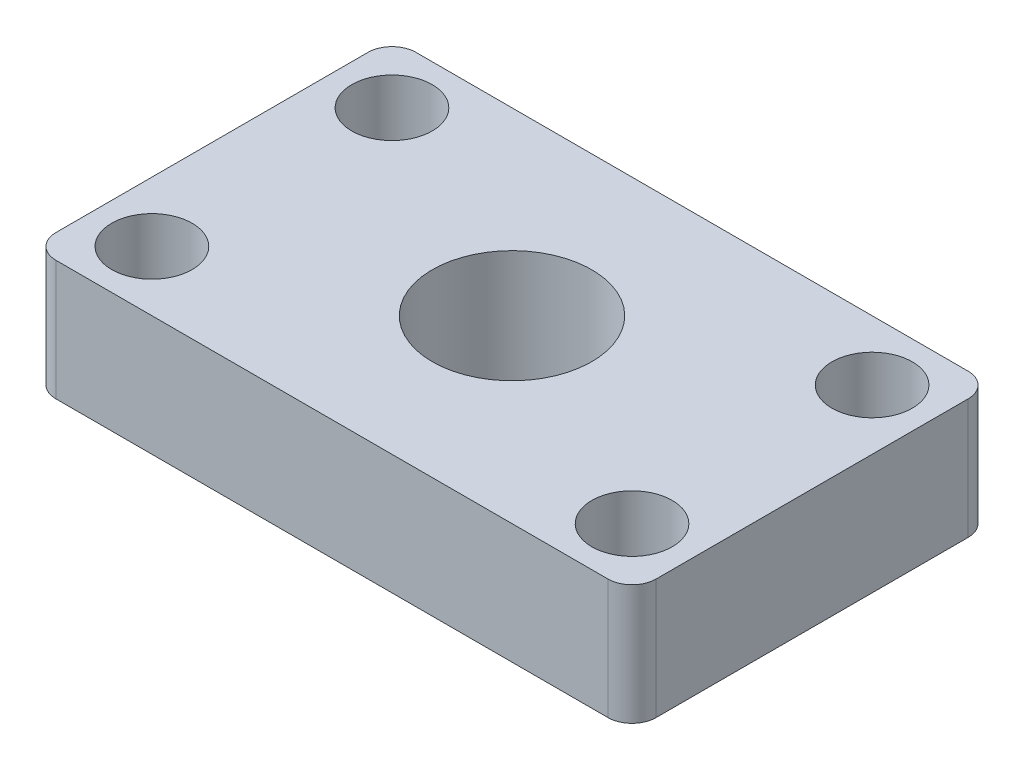
ISO-10303-21;
HEADER;
FILE_DESCRIPTION(('STEP AP214'),'2;1');
FILE_NAME('part.step','',(''),(''),'','','');
FILE_SCHEMA(('AUTOMOTIVE_DESIGN { 1 0 10303 214 1 1 1 1 }'));
ENDSEC;
DATA;
#1=APPLICATION_CONTEXT('core data for automotive mechanical design processes');
#2=APPLICATION_PROTOCOL_DEFINITION('international standard','automotive_design',2000,#1);
#3=PRODUCT_CONTEXT('',#1,'mechanical');
#4=PRODUCT('Part','Part','',(#3));
#5=PRODUCT_RELATED_PRODUCT_CATEGORY('part','',(#4));
#6=PRODUCT_DEFINITION_FORMATION('','',#4);
#7=PRODUCT_DEFINITION_CONTEXT('part definition',#1,'design');
#8=PRODUCT_DEFINITION('design','',#6,#7);
#9=PRODUCT_DEFINITION_SHAPE('','',#8);
#10=(LENGTH_UNIT() NAMED_UNIT(*) SI_UNIT(.MILLI.,.METRE.));
#11=(NAMED_UNIT(*) PLANE_ANGLE_UNIT() SI_UNIT($,.RADIAN.));
#12=(NAMED_UNIT(*) SI_UNIT($,.STERADIAN.) SOLID_ANGLE_UNIT());
#13=UNCERTAINTY_MEASURE_WITH_UNIT(LENGTH_MEASURE(1.E-05),#10,'distance_accuracy_value','');
#14=(GEOMETRIC_REPRESENTATION_CONTEXT(3) GLOBAL_UNCERTAINTY_ASSIGNED_CONTEXT((#13)) GLOBAL_UNIT_ASSIGNED_CONTEXT((#10,
#11,#12)) REPRESENTATION_CONTEXT('',''));
#15=CARTESIAN_POINT('',(0.,0.,0.));
#16=DIRECTION('',(0.,0.,1.));
#17=DIRECTION('',(1.,0.,0.));
#18=AXIS2_PLACEMENT_3D('',#15,#16,#17);
#19=CARTESIAN_POINT('',(0.,10.,0.));
#20=DIRECTION('',(0.,1.,0.));
#21=DIRECTION('',(0.,0.,1.));
#22=AXIS2_PLACEMENT_3D('',#19,#20,#21);
#23=PLANE('',#22);
#24=CARTESIAN_POINT('',(0.,10.,0.));
#25=DIRECTION('',(0.,1.,0.));
#26=DIRECTION('',(0.,0.,1.));
#27=AXIS2_PLACEMENT_3D('',#24,#25,#26);
#28=CIRCLE('',#27,6.64209999999999);
#29=CARTESIAN_POINT('',(0.,10.,6.64209999999999));
#30=VERTEX_POINT('',#29);
#31=EDGE_CURVE('E429',#30,#30,#28,.T.);
#32=ORIENTED_EDGE('',*,*,#31,.F.);
#33=EDGE_LOOP('',(#32));
#34=FACE_BOUND('',#33,.T.);
#35=CARTESIAN_POINT('',(-20.,10.,10.));
#36=DIRECTION('',(0.,1.,0.));
#37=DIRECTION('',(0.,0.,1.));
#38=AXIS2_PLACEMENT_3D('',#35,#36,#37);
#39=CIRCLE('',#38,3.35);
#40=CARTESIAN_POINT('',(-20.,10.,13.35));
#41=VERTEX_POINT('',#40);
#42=EDGE_CURVE('E144',#41,#41,#39,.T.);
#43=ORIENTED_EDGE('',*,*,#42,.F.);
#44=EDGE_LOOP('',(#43));
#45=FACE_BOUND('',#44,.T.);
#46=CARTESIAN_POINT('',(20.,10.,-10.));
#47=DIRECTION('',(0.,1.,0.));
#48=DIRECTION('',(0.,0.,1.));
#49=AXIS2_PLACEMENT_3D('',#46,#47,#48);
#50=CIRCLE('',#49,3.35);
#51=CARTESIAN_POINT('',(20.,10.,-6.65));
#52=VERTEX_POINT('',#51);
#53=EDGE_CURVE('E156',#52,#52,#50,.T.);
#54=ORIENTED_EDGE('',*,*,#53,.F.);
#55=EDGE_LOOP('',(#54));
#56=FACE_BOUND('',#55,.T.);
#57=DIRECTION('',(0.,0.,1.));
#58=VECTOR('',#57,1.);
#59=CARTESIAN_POINT('',(-25.,10.,-15.));
#60=LINE('',#59,#58);
#61=CARTESIAN_POINT('',(-25.,10.,-13.));
#62=VERTEX_POINT('',#61);
#63=CARTESIAN_POINT('',(-25.,10.,13.));
#64=VERTEX_POINT('',#63);
#65=EDGE_CURVE('E169',#62,#64,#60,.T.);
#66=ORIENTED_EDGE('',*,*,#65,.T.);
#67=CARTESIAN_POINT('',(-23.,10.,13.));
#68=DIRECTION('',(0.,1.,0.));
#69=DIRECTION('',(0.,0.,1.));
#70=AXIS2_PLACEMENT_3D('',#67,#68,#69);
#71=CIRCLE('',#70,2.);
#72=CARTESIAN_POINT('',(-23.,10.,15.));
#73=VERTEX_POINT('',#72);
#74=EDGE_CURVE('E13',#64,#73,#71,.T.);
#75=ORIENTED_EDGE('',*,*,#74,.T.);
#76=DIRECTION('',(1.,0.,0.));
#77=VECTOR('',#76,1.);
#78=CARTESIAN_POINT('',(-25.,10.,15.));
#79=LINE('',#78,#77);
#80=CARTESIAN_POINT('',(23.,10.,15.));
#81=VERTEX_POINT('',#80);
#82=EDGE_CURVE('E171',#73,#81,#79,.T.);
#83=ORIENTED_EDGE('',*,*,#82,.T.);
#84=CARTESIAN_POINT('',(23.,10.,13.));
#85=DIRECTION('',(0.,1.,0.));
#86=DIRECTION('',(0.,0.,1.));
#87=AXIS2_PLACEMENT_3D('',#84,#85,#86);
#88=CIRCLE('',#87,2.);
#89=CARTESIAN_POINT('',(25.,10.,13.));
#90=VERTEX_POINT('',#89);
#91=EDGE_CURVE('E198',#81,#90,#88,.T.);
#92=ORIENTED_EDGE('',*,*,#91,.T.);
#93=DIRECTION('',(0.,0.,-1.));
#94=VECTOR('',#93,1.);
#95=CARTESIAN_POINT('',(25.,10.,-15.));
#96=LINE('',#95,#94);
#97=CARTESIAN_POINT('',(25.,10.,-13.));
#98=VERTEX_POINT('',#97);
#99=EDGE_CURVE('E162',#90,#98,#96,.T.);
#100=ORIENTED_EDGE('',*,*,#99,.T.);
#101=CARTESIAN_POINT('',(23.,10.,-13.));
#102=DIRECTION('',(0.,1.,0.));
#103=DIRECTION('',(0.,0.,1.));
#104=AXIS2_PLACEMENT_3D('',#101,#102,#103);
#105=CIRCLE('',#104,2.);
#106=CARTESIAN_POINT('',(23.,10.,-15.));
#107=VERTEX_POINT('',#106);
#108=EDGE_CURVE('E196',#98,#107,#105,.T.);
#109=ORIENTED_EDGE('',*,*,#108,.T.);
#110=DIRECTION('',(-1.,0.,0.));
#111=VECTOR('',#110,1.);
#112=CARTESIAN_POINT('',(-25.,10.,-15.));
#113=LINE('',#112,#111);
#114=CARTESIAN_POINT('',(-23.,10.,-15.));
#115=VERTEX_POINT('',#114);
#116=EDGE_CURVE('E165',#107,#115,#113,.T.);
#117=ORIENTED_EDGE('',*,*,#116,.T.);
#118=CARTESIAN_POINT('',(-23.,10.,-13.));
#119=DIRECTION('',(0.,1.,0.));
#120=DIRECTION('',(0.,0.,1.));
#121=AXIS2_PLACEMENT_3D('',#118,#119,#120);
#122=CIRCLE('',#121,2.);
#123=EDGE_CURVE('E200',#115,#62,#122,.T.);
#124=ORIENTED_EDGE('',*,*,#123,.T.);
#125=EDGE_LOOP('',(#66,#75,#83,#92,#100,#109,#117,#124));
#126=FACE_BOUND('',#125,.T.);
#127=CARTESIAN_POINT('',(-20.,10.,-10.));
#128=DIRECTION('',(0.,1.,0.));
#129=DIRECTION('',(0.,0.,1.));
#130=AXIS2_PLACEMENT_3D('',#127,#128,#129);
#131=CIRCLE('',#130,3.35);
#132=CARTESIAN_POINT('',(-20.,10.,-6.65));
#133=VERTEX_POINT('',#132);
#134=EDGE_CURVE('E150',#133,#133,#131,.T.);
#135=ORIENTED_EDGE('',*,*,#134,.F.);
#136=EDGE_LOOP('',(#135));
#137=FACE_BOUND('',#136,.T.);
#138=CARTESIAN_POINT('',(20.,10.,10.));
#139=DIRECTION('',(0.,1.,0.));
#140=DIRECTION('',(0.,0.,1.));
#141=AXIS2_PLACEMENT_3D('',#138,#139,#140);
#142=CIRCLE('',#141,3.35);
#143=CARTESIAN_POINT('',(20.,10.,13.35));
#144=VERTEX_POINT('',#143);
#145=EDGE_CURVE('E134',#144,#144,#142,.T.);
#146=ORIENTED_EDGE('',*,*,#145,.F.);
#147=EDGE_LOOP('',(#146));
#148=FACE_BOUND('',#147,.T.);
#149=ADVANCED_FACE('F54',(#34,#45,#56,#126,#137,#148),#23,.T.);
#150=CARTESIAN_POINT('',(0.,0.,0.));
#151=DIRECTION('',(0.,1.,0.));
#152=DIRECTION('',(0.,0.,1.));
#153=AXIS2_PLACEMENT_3D('',#150,#151,#152);
#154=PLANE('',#153);
#155=CARTESIAN_POINT('',(0.,0.,0.));
#156=DIRECTION('',(0.,1.,0.));
#157=DIRECTION('',(0.,0.,1.));
#158=AXIS2_PLACEMENT_3D('',#155,#156,#157);
#159=CIRCLE('',#158,6.6421);
#160=CARTESIAN_POINT('',(0.,0.,6.6421));
#161=VERTEX_POINT('',#160);
#162=EDGE_CURVE('E137',#161,#161,#159,.T.);
#163=ORIENTED_EDGE('',*,*,#162,.T.);
#164=EDGE_LOOP('',(#163));
#165=FACE_BOUND('',#164,.T.);
#166=DIRECTION('',(1.,0.,0.));
#167=VECTOR('',#166,1.);
#168=CARTESIAN_POINT('',(-25.,0.,15.));
#169=LINE('',#168,#167);
#170=CARTESIAN_POINT('',(-23.,0.,15.));
#171=VERTEX_POINT('',#170);
#172=CARTESIAN_POINT('',(23.,0.,15.));
#173=VERTEX_POINT('',#172);
#174=EDGE_CURVE('E166',#171,#173,#169,.T.);
#175=ORIENTED_EDGE('',*,*,#174,.F.);
#176=CARTESIAN_POINT('',(-23.,0.,13.));
#177=DIRECTION('',(0.,1.,0.));
#178=DIRECTION('',(0.,0.,1.));
#179=AXIS2_PLACEMENT_3D('',#176,#177,#178);
#180=CIRCLE('',#179,2.);
#181=CARTESIAN_POINT('',(-25.,0.,13.));
#182=VERTEX_POINT('',#181);
#183=EDGE_CURVE('E76',#171,#182,#180,.F.);
#184=ORIENTED_EDGE('',*,*,#183,.T.);
#185=DIRECTION('',(0.,0.,1.));
#186=VECTOR('',#185,1.);
#187=CARTESIAN_POINT('',(-25.,0.,-15.));
#188=LINE('',#187,#186);
#189=CARTESIAN_POINT('',(-25.,0.,-13.));
#190=VERTEX_POINT('',#189);
#191=EDGE_CURVE('E179',#190,#182,#188,.T.);
#192=ORIENTED_EDGE('',*,*,#191,.F.);
#193=CARTESIAN_POINT('',(-23.,0.,-13.));
#194=DIRECTION('',(0.,1.,0.));
#195=DIRECTION('',(0.,0.,1.));
#196=AXIS2_PLACEMENT_3D('',#193,#194,#195);
#197=CIRCLE('',#196,2.);
#198=CARTESIAN_POINT('',(-23.,0.,-15.));
#199=VERTEX_POINT('',#198);
#200=EDGE_CURVE('E189',#190,#199,#197,.F.);
#201=ORIENTED_EDGE('',*,*,#200,.T.);
#202=DIRECTION('',(-1.,0.,0.));
#203=VECTOR('',#202,1.);
#204=CARTESIAN_POINT('',(-25.,0.,-15.));
#205=LINE('',#204,#203);
#206=CARTESIAN_POINT('',(23.,0.,-15.));
#207=VERTEX_POINT('',#206);
#208=EDGE_CURVE('E176',#207,#199,#205,.T.);
#209=ORIENTED_EDGE('',*,*,#208,.F.);
#210=CARTESIAN_POINT('',(23.,0.,-13.));
#211=DIRECTION('',(0.,1.,0.));
#212=DIRECTION('',(0.,0.,1.));
#213=AXIS2_PLACEMENT_3D('',#210,#211,#212);
#214=CIRCLE('',#213,2.);
#215=CARTESIAN_POINT('',(25.,0.,-13.));
#216=VERTEX_POINT('',#215);
#217=EDGE_CURVE('E184',#207,#216,#214,.F.);
#218=ORIENTED_EDGE('',*,*,#217,.T.);
#219=DIRECTION('',(0.,0.,-1.));
#220=VECTOR('',#219,1.);
#221=CARTESIAN_POINT('',(25.,0.,-15.));
#222=LINE('',#221,#220);
#223=CARTESIAN_POINT('',(25.,0.,13.));
#224=VERTEX_POINT('',#223);
#225=EDGE_CURVE('E159',#224,#216,#222,.T.);
#226=ORIENTED_EDGE('',*,*,#225,.F.);
#227=CARTESIAN_POINT('',(23.,0.,13.));
#228=DIRECTION('',(0.,1.,0.));
#229=DIRECTION('',(0.,0.,1.));
#230=AXIS2_PLACEMENT_3D('',#227,#228,#229);
#231=CIRCLE('',#230,2.);
#232=EDGE_CURVE('E186',#224,#173,#231,.F.);
#233=ORIENTED_EDGE('',*,*,#232,.T.);
#234=EDGE_LOOP('',(#175,#184,#192,#201,#209,#218,#226,#233));
#235=FACE_BOUND('',#234,.T.);
#236=CARTESIAN_POINT('',(20.,0.,-10.));
#237=DIRECTION('',(0.,1.,0.));
#238=DIRECTION('',(0.,0.,1.));
#239=AXIS2_PLACEMENT_3D('',#236,#237,#238);
#240=CIRCLE('',#239,3.35);
#241=CARTESIAN_POINT('',(20.,0.,-6.65));
#242=VERTEX_POINT('',#241);
#243=EDGE_CURVE('E153',#242,#242,#240,.T.);
#244=ORIENTED_EDGE('',*,*,#243,.T.);
#245=EDGE_LOOP('',(#244));
#246=FACE_BOUND('',#245,.T.);
#247=CARTESIAN_POINT('',(-20.,0.,-10.));
#248=DIRECTION('',(0.,1.,0.));
#249=DIRECTION('',(0.,0.,1.));
#250=AXIS2_PLACEMENT_3D('',#247,#248,#249);
#251=CIRCLE('',#250,3.35);
#252=CARTESIAN_POINT('',(-20.,0.,-6.65));
#253=VERTEX_POINT('',#252);
#254=EDGE_CURVE('E147',#253,#253,#251,.T.);
#255=ORIENTED_EDGE('',*,*,#254,.T.);
#256=EDGE_LOOP('',(#255));
#257=FACE_BOUND('',#256,.T.);
#258=CARTESIAN_POINT('',(-20.,0.,10.));
#259=DIRECTION('',(0.,1.,0.));
#260=DIRECTION('',(0.,0.,1.));
#261=AXIS2_PLACEMENT_3D('',#258,#259,#260);
#262=CIRCLE('',#261,3.35);
#263=CARTESIAN_POINT('',(-20.,0.,13.35));
#264=VERTEX_POINT('',#263);
#265=EDGE_CURVE('E142',#264,#264,#262,.T.);
#266=ORIENTED_EDGE('',*,*,#265,.T.);
#267=EDGE_LOOP('',(#266));
#268=FACE_BOUND('',#267,.T.);
#269=CARTESIAN_POINT('',(20.,0.,10.));
#270=DIRECTION('',(0.,1.,0.));
#271=DIRECTION('',(0.,0.,1.));
#272=AXIS2_PLACEMENT_3D('',#269,#270,#271);
#273=CIRCLE('',#272,3.35);
#274=CARTESIAN_POINT('',(20.,0.,13.35));
#275=VERTEX_POINT('',#274);
#276=EDGE_CURVE('E130',#275,#275,#273,.T.);
#277=ORIENTED_EDGE('',*,*,#276,.T.);
#278=EDGE_LOOP('',(#277));
#279=FACE_BOUND('',#278,.T.);
#280=ADVANCED_FACE('F219',(#165,#235,#246,#257,#268,#279),#154,.F.);
#281=CARTESIAN_POINT('',(25.,10.,-15.));
#282=DIRECTION('',(-1.,0.,0.));
#283=DIRECTION('',(0.,0.,1.));
#284=AXIS2_PLACEMENT_3D('',#281,#282,#283);
#285=PLANE('',#284);
#286=ORIENTED_EDGE('',*,*,#99,.F.);
#287=DIRECTION('',(0.,-1.,0.));
#288=VECTOR('',#287,1.);
#289=CARTESIAN_POINT('',(25.,10.,13.));
#290=LINE('',#289,#288);
#291=EDGE_CURVE('E204',#90,#224,#290,.T.);
#292=ORIENTED_EDGE('',*,*,#291,.T.);
#293=ORIENTED_EDGE('',*,*,#225,.T.);
#294=DIRECTION('',(0.,-1.,0.));
#295=VECTOR('',#294,1.);
#296=CARTESIAN_POINT('',(25.,10.,-13.));
#297=LINE('',#296,#295);
#298=EDGE_CURVE('E202',#216,#98,#297,.F.);
#299=ORIENTED_EDGE('',*,*,#298,.T.);
#300=EDGE_LOOP('',(#286,#292,#293,#299));
#301=FACE_BOUND('',#300,.T.);
#302=ADVANCED_FACE('F232',(#301),#285,.F.);
#303=CARTESIAN_POINT('',(-25.,10.,-15.));
#304=DIRECTION('',(0.,0.,1.));
#305=DIRECTION('',(1.,0.,0.));
#306=AXIS2_PLACEMENT_3D('',#303,#304,#305);
#307=PLANE('',#306);
#308=CARTESIAN_POINT('',(0.,5.,-15.));
#309=DIRECTION('',(0.,0.,-1.));
#310=DIRECTION('',(-1.,0.,0.));
#311=AXIS2_PLACEMENT_3D('',#308,#309,#310);
#312=CIRCLE('',#311,1.72719999999999);
#313=CARTESIAN_POINT('',(-1.72719999999999,5.,-15.));
#314=VERTEX_POINT('',#313);
#315=EDGE_CURVE('E131',#314,#314,#312,.T.);
#316=ORIENTED_EDGE('',*,*,#315,.F.);
#317=EDGE_LOOP('',(#316));
#318=FACE_BOUND('',#317,.T.);
#319=ORIENTED_EDGE('',*,*,#208,.T.);
#320=DIRECTION('',(0.,-1.,0.));
#321=VECTOR('',#320,1.);
#322=CARTESIAN_POINT('',(-23.,10.,-15.));
#323=LINE('',#322,#321);
#324=EDGE_CURVE('E194',#199,#115,#323,.F.);
#325=ORIENTED_EDGE('',*,*,#324,.T.);
#326=ORIENTED_EDGE('',*,*,#116,.F.);
#327=DIRECTION('',(0.,-1.,0.));
#328=VECTOR('',#327,1.);
#329=CARTESIAN_POINT('',(23.,10.,-15.));
#330=LINE('',#329,#328);
#331=EDGE_CURVE('E191',#107,#207,#330,.T.);
#332=ORIENTED_EDGE('',*,*,#331,.T.);
#333=EDGE_LOOP('',(#319,#325,#326,#332));
#334=FACE_BOUND('',#333,.T.);
#335=ADVANCED_FACE('F240',(#318,#334),#307,.F.);
#336=CARTESIAN_POINT('',(-25.,10.,-15.));
#337=DIRECTION('',(1.,0.,0.));
#338=DIRECTION('',(0.,0.,-1.));
#339=AXIS2_PLACEMENT_3D('',#336,#337,#338);
#340=PLANE('',#339);
#341=ORIENTED_EDGE('',*,*,#191,.T.);
#342=DIRECTION('',(0.,-1.,0.));
#343=VECTOR('',#342,1.);
#344=CARTESIAN_POINT('',(-25.,10.,13.));
#345=LINE('',#344,#343);
#346=EDGE_CURVE('E62',#182,#64,#345,.F.);
#347=ORIENTED_EDGE('',*,*,#346,.T.);
#348=ORIENTED_EDGE('',*,*,#65,.F.);
#349=DIRECTION('',(0.,-1.,0.));
#350=VECTOR('',#349,1.);
#351=CARTESIAN_POINT('',(-25.,10.,-13.));
#352=LINE('',#351,#350);
#353=EDGE_CURVE('E173',#62,#190,#352,.T.);
#354=ORIENTED_EDGE('',*,*,#353,.T.);
#355=EDGE_LOOP('',(#341,#347,#348,#354));
#356=FACE_BOUND('',#355,.T.);
#357=ADVANCED_FACE('F246',(#356),#340,.F.);
#358=CARTESIAN_POINT('',(-25.,10.,15.));
#359=DIRECTION('',(0.,0.,-1.));
#360=DIRECTION('',(-1.,0.,0.));
#361=AXIS2_PLACEMENT_3D('',#358,#359,#360);
#362=PLANE('',#361);
#363=ORIENTED_EDGE('',*,*,#82,.F.);
#364=DIRECTION('',(0.,-1.,0.));
#365=VECTOR('',#364,1.);
#366=CARTESIAN_POINT('',(-23.,10.,15.));
#367=LINE('',#366,#365);
#368=EDGE_CURVE('E210',#73,#171,#367,.T.);
#369=ORIENTED_EDGE('',*,*,#368,.T.);
#370=ORIENTED_EDGE('',*,*,#174,.T.);
#371=DIRECTION('',(0.,-1.,0.));
#372=VECTOR('',#371,1.);
#373=CARTESIAN_POINT('',(23.,10.,15.));
#374=LINE('',#373,#372);
#375=EDGE_CURVE('E207',#173,#81,#374,.F.);
#376=ORIENTED_EDGE('',*,*,#375,.T.);
#377=EDGE_LOOP('',(#363,#369,#370,#376));
#378=FACE_BOUND('',#377,.T.);
#379=ADVANCED_FACE('F216',(#378),#362,.F.);
#380=CARTESIAN_POINT('',(20.,10.,-10.));
#381=DIRECTION('',(0.,-1.,0.));
#382=DIRECTION('',(0.,0.,-1.));
#383=AXIS2_PLACEMENT_3D('',#380,#381,#382);
#384=CYLINDRICAL_SURFACE('',#383,3.35);
#385=ORIENTED_EDGE('',*,*,#53,.T.);
#386=EDGE_LOOP('',(#385));
#387=FACE_BOUND('',#386,.T.);
#388=ORIENTED_EDGE('',*,*,#243,.F.);
#389=EDGE_LOOP('',(#388));
#390=FACE_BOUND('',#389,.T.);
#391=ADVANCED_FACE('F266',(#387,#390),#384,.F.);
#392=CARTESIAN_POINT('',(-20.,10.,-10.));
#393=DIRECTION('',(0.,-1.,0.));
#394=DIRECTION('',(0.,0.,-1.));
#395=AXIS2_PLACEMENT_3D('',#392,#393,#394);
#396=CYLINDRICAL_SURFACE('',#395,3.35);
#397=ORIENTED_EDGE('',*,*,#134,.T.);
#398=EDGE_LOOP('',(#397));
#399=FACE_BOUND('',#398,.T.);
#400=ORIENTED_EDGE('',*,*,#254,.F.);
#401=EDGE_LOOP('',(#400));
#402=FACE_BOUND('',#401,.T.);
#403=ADVANCED_FACE('F383',(#399,#402),#396,.F.);
#404=CARTESIAN_POINT('',(-20.,10.,10.));
#405=DIRECTION('',(0.,-1.,0.));
#406=DIRECTION('',(0.,0.,-1.));
#407=AXIS2_PLACEMENT_3D('',#404,#405,#406);
#408=CYLINDRICAL_SURFACE('',#407,3.35);
#409=ORIENTED_EDGE('',*,*,#42,.T.);
#410=EDGE_LOOP('',(#409));
#411=FACE_BOUND('',#410,.T.);
#412=ORIENTED_EDGE('',*,*,#265,.F.);
#413=EDGE_LOOP('',(#412));
#414=FACE_BOUND('',#413,.T.);
#415=ADVANCED_FACE('F374',(#411,#414),#408,.F.);
#416=CARTESIAN_POINT('',(20.,10.,10.));
#417=DIRECTION('',(0.,-1.,0.));
#418=DIRECTION('',(0.,0.,-1.));
#419=AXIS2_PLACEMENT_3D('',#416,#417,#418);
#420=CYLINDRICAL_SURFACE('',#419,3.35);
#421=ORIENTED_EDGE('',*,*,#145,.T.);
#422=EDGE_LOOP('',(#421));
#423=FACE_BOUND('',#422,.T.);
#424=ORIENTED_EDGE('',*,*,#276,.F.);
#425=EDGE_LOOP('',(#424));
#426=FACE_BOUND('',#425,.T.);
#427=ADVANCED_FACE('F124',(#423,#426),#420,.F.);
#428=CARTESIAN_POINT('',(0.,5.,-10.));
#429=DIRECTION('',(0.,0.,-1.));
#430=DIRECTION('',(-1.,0.,0.));
#431=AXIS2_PLACEMENT_3D('',#428,#429,#430);
#432=CONICAL_SURFACE('',#431,1.7272,1.02974425867665);
#433=CARTESIAN_POINT('',(0.,5.,-8.9621935388156));
#434=VERTEX_POINT('',#433);
#435=VERTEX_LOOP('',#434);
#436=FACE_BOUND('',#435,.T.);
#437=CARTESIAN_POINT('',(0.,5.,-10.));
#438=DIRECTION('',(0.,0.,-1.));
#439=DIRECTION('',(-1.,0.,0.));
#440=AXIS2_PLACEMENT_3D('',#437,#438,#439);
#441=CIRCLE('',#440,1.7272);
#442=CARTESIAN_POINT('',(-1.7272,5.,-10.));
#443=VERTEX_POINT('',#442);
#444=EDGE_CURVE('E128',#443,#443,#441,.T.);
#445=ORIENTED_EDGE('',*,*,#444,.T.);
#446=EDGE_LOOP('',(#445));
#447=FACE_BOUND('',#446,.T.);
#448=ADVANCED_FACE('F120',(#436,#447),#432,.F.);
#449=CARTESIAN_POINT('',(0.,5.,-15.));
#450=DIRECTION('',(0.,0.,-1.));
#451=DIRECTION('',(-1.,0.,0.));
#452=AXIS2_PLACEMENT_3D('',#449,#450,#451);
#453=CYLINDRICAL_SURFACE('',#452,1.72719999999999);
#454=ORIENTED_EDGE('',*,*,#444,.F.);
#455=EDGE_LOOP('',(#454));
#456=FACE_BOUND('',#455,.T.);
#457=ORIENTED_EDGE('',*,*,#315,.T.);
#458=EDGE_LOOP('',(#457));
#459=FACE_BOUND('',#458,.T.);
#460=ADVANCED_FACE('F123',(#456,#459),#453,.F.);
#461=CARTESIAN_POINT('',(-23.,10.,-13.));
#462=DIRECTION('',(0.,-1.,0.));
#463=DIRECTION('',(0.,0.,-1.));
#464=AXIS2_PLACEMENT_3D('',#461,#462,#463);
#465=CYLINDRICAL_SURFACE('',#464,2.);
#466=ORIENTED_EDGE('',*,*,#123,.F.);
#467=ORIENTED_EDGE('',*,*,#324,.F.);
#468=ORIENTED_EDGE('',*,*,#200,.F.);
#469=ORIENTED_EDGE('',*,*,#353,.F.);
#470=EDGE_LOOP('',(#466,#467,#468,#469));
#471=FACE_BOUND('',#470,.T.);
#472=ADVANCED_FACE('F244',(#471),#465,.T.);
#473=CARTESIAN_POINT('',(23.,10.,13.));
#474=DIRECTION('',(0.,-1.,0.));
#475=DIRECTION('',(0.,0.,-1.));
#476=AXIS2_PLACEMENT_3D('',#473,#474,#475);
#477=CYLINDRICAL_SURFACE('',#476,2.);
#478=ORIENTED_EDGE('',*,*,#91,.F.);
#479=ORIENTED_EDGE('',*,*,#375,.F.);
#480=ORIENTED_EDGE('',*,*,#232,.F.);
#481=ORIENTED_EDGE('',*,*,#291,.F.);
#482=EDGE_LOOP('',(#478,#479,#480,#481));
#483=FACE_BOUND('',#482,.T.);
#484=ADVANCED_FACE('F226',(#483),#477,.T.);
#485=CARTESIAN_POINT('',(23.,10.,-13.));
#486=DIRECTION('',(0.,-1.,0.));
#487=DIRECTION('',(0.,0.,-1.));
#488=AXIS2_PLACEMENT_3D('',#485,#486,#487);
#489=CYLINDRICAL_SURFACE('',#488,2.);
#490=ORIENTED_EDGE('',*,*,#108,.F.);
#491=ORIENTED_EDGE('',*,*,#298,.F.);
#492=ORIENTED_EDGE('',*,*,#217,.F.);
#493=ORIENTED_EDGE('',*,*,#331,.F.);
#494=EDGE_LOOP('',(#490,#491,#492,#493));
#495=FACE_BOUND('',#494,.T.);
#496=ADVANCED_FACE('F235',(#495),#489,.T.);
#497=CARTESIAN_POINT('',(-23.,10.,13.));
#498=DIRECTION('',(0.,-1.,0.));
#499=DIRECTION('',(0.,0.,-1.));
#500=AXIS2_PLACEMENT_3D('',#497,#498,#499);
#501=CYLINDRICAL_SURFACE('',#500,2.);
#502=ORIENTED_EDGE('',*,*,#74,.F.);
#503=ORIENTED_EDGE('',*,*,#346,.F.);
#504=ORIENTED_EDGE('',*,*,#183,.F.);
#505=ORIENTED_EDGE('',*,*,#368,.F.);
#506=EDGE_LOOP('',(#502,#503,#504,#505));
#507=FACE_BOUND('',#506,.T.);
#508=ADVANCED_FACE('F56',(#507),#501,.T.);
#509=CARTESIAN_POINT('',(0.,10.,0.));
#510=DIRECTION('',(0.,1.,0.));
#511=DIRECTION('',(0.,0.,1.));
#512=AXIS2_PLACEMENT_3D('',#509,#510,#511);
#513=CYLINDRICAL_SURFACE('',#512,6.64209999999999);
#514=ORIENTED_EDGE('',*,*,#162,.F.);
#515=EDGE_LOOP('',(#514));
#516=FACE_BOUND('',#515,.T.);
#517=ORIENTED_EDGE('',*,*,#31,.T.);
#518=EDGE_LOOP('',(#517));
#519=FACE_BOUND('',#518,.T.);
#520=ADVANCED_FACE('F248',(#516,#519),#513,.F.);
#521=CLOSED_SHELL('',(#149,#280,#302,#335,#357,#379,#391,#403,#415,#427,#448,#460,#472,#484,
#496,#508,#520));
#522=MANIFOLD_SOLID_BREP('B2',#521);
#523=ADVANCED_BREP_SHAPE_REPRESENTATION('',(#18,#522),#14);
#524=SHAPE_DEFINITION_REPRESENTATION(#9,#523);
ENDSEC;
END-ISO-10303-21;
